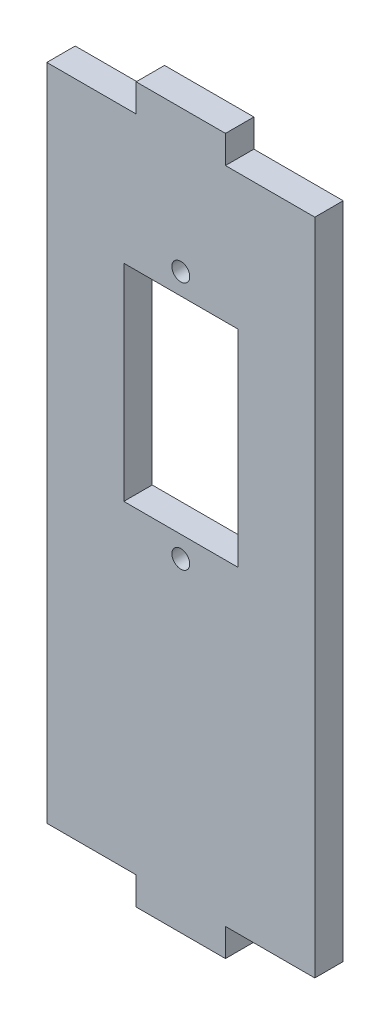
ISO-10303-21;
HEADER;
FILE_DESCRIPTION(('STEP AP214'),'2;1');
FILE_NAME('part.step','',(''),(''),'','','');
FILE_SCHEMA(('AUTOMOTIVE_DESIGN { 1 0 10303 214 1 1 1 1 }'));
ENDSEC;
DATA;
#1=APPLICATION_CONTEXT('core data for automotive mechanical design processes');
#2=APPLICATION_PROTOCOL_DEFINITION('international standard','automotive_design',2000,#1);
#3=PRODUCT_CONTEXT('',#1,'mechanical');
#4=PRODUCT('Part','Part','',(#3));
#5=PRODUCT_RELATED_PRODUCT_CATEGORY('part','',(#4));
#6=PRODUCT_DEFINITION_FORMATION('','',#4);
#7=PRODUCT_DEFINITION_CONTEXT('part definition',#1,'design');
#8=PRODUCT_DEFINITION('design','',#6,#7);
#9=PRODUCT_DEFINITION_SHAPE('','',#8);
#10=(LENGTH_UNIT() NAMED_UNIT(*) SI_UNIT(.MILLI.,.METRE.));
#11=(NAMED_UNIT(*) PLANE_ANGLE_UNIT() SI_UNIT($,.RADIAN.));
#12=(NAMED_UNIT(*) SI_UNIT($,.STERADIAN.) SOLID_ANGLE_UNIT());
#13=UNCERTAINTY_MEASURE_WITH_UNIT(LENGTH_MEASURE(1.E-05),#10,'distance_accuracy_value','');
#14=(GEOMETRIC_REPRESENTATION_CONTEXT(3) GLOBAL_UNCERTAINTY_ASSIGNED_CONTEXT((#13)) GLOBAL_UNIT_ASSIGNED_CONTEXT((#10,
#11,#12)) REPRESENTATION_CONTEXT('',''));
#15=CARTESIAN_POINT('',(0.,0.,0.));
#16=DIRECTION('',(0.,0.,1.));
#17=DIRECTION('',(1.,0.,0.));
#18=AXIS2_PLACEMENT_3D('',#15,#16,#17);
#19=CARTESIAN_POINT('',(0.,0.,3.18));
#20=DIRECTION('',(0.,0.,1.));
#21=DIRECTION('',(1.,0.,0.));
#22=AXIS2_PLACEMENT_3D('',#19,#20,#21);
#23=PLANE('',#22);
#24=CARTESIAN_POINT('',(0.,24.1003609859653,3.18000000000001));
#25=DIRECTION('',(0.,0.,-1.));
#26=DIRECTION('',(-1.,0.,0.));
#27=AXIS2_PLACEMENT_3D('',#24,#25,#26);
#28=CIRCLE('',#27,0.999999999999999);
#29=CARTESIAN_POINT('',(-1.,24.1003609859653,3.18000000000001));
#30=VERTEX_POINT('',#29);
#31=EDGE_CURVE('E552',#30,#30,#28,.T.);
#32=ORIENTED_EDGE('',*,*,#31,.T.);
#33=EDGE_LOOP('',(#32));
#34=FACE_BOUND('',#33,.T.);
#35=CARTESIAN_POINT('',(0.,-3.74598658140914,3.18000000000001));
#36=DIRECTION('',(0.,0.,-1.));
#37=DIRECTION('',(-1.,0.,0.));
#38=AXIS2_PLACEMENT_3D('',#35,#36,#37);
#39=CIRCLE('',#38,1.);
#40=CARTESIAN_POINT('',(-1.,-3.74598658140914,3.18000000000001));
#41=VERTEX_POINT('',#40);
#42=EDGE_CURVE('E557',#41,#41,#39,.T.);
#43=ORIENTED_EDGE('',*,*,#42,.T.);
#44=EDGE_LOOP('',(#43));
#45=FACE_BOUND('',#44,.T.);
#46=DIRECTION('',(1.,0.,0.));
#47=VECTOR('',#46,1.);
#48=CARTESIAN_POINT('',(-6.38,21.7253609859653,3.18));
#49=LINE('',#48,#47);
#50=CARTESIAN_POINT('',(-6.38,21.7253609859653,3.18));
#51=VERTEX_POINT('',#50);
#52=CARTESIAN_POINT('',(6.38,21.7253609859653,3.18000000000001));
#53=VERTEX_POINT('',#52);
#54=EDGE_CURVE('E182',#51,#53,#49,.T.);
#55=ORIENTED_EDGE('',*,*,#54,.T.);
#56=DIRECTION('',(0.,-1.,0.));
#57=VECTOR('',#56,1.);
#58=CARTESIAN_POINT('',(6.38,21.7253609859653,3.18));
#59=LINE('',#58,#57);
#60=CARTESIAN_POINT('',(6.38,-1.36598658140914,3.18));
#61=VERTEX_POINT('',#60);
#62=EDGE_CURVE('E168',#53,#61,#59,.T.);
#63=ORIENTED_EDGE('',*,*,#62,.T.);
#64=DIRECTION('',(-1.,0.,0.));
#65=VECTOR('',#64,1.);
#66=CARTESIAN_POINT('',(-6.38000000000001,-1.36598658140913,3.18));
#67=LINE('',#66,#65);
#68=CARTESIAN_POINT('',(-6.38000000000001,-1.36598658140913,3.18));
#69=VERTEX_POINT('',#68);
#70=EDGE_CURVE('E203',#61,#69,#67,.T.);
#71=ORIENTED_EDGE('',*,*,#70,.T.);
#72=DIRECTION('',(0.,1.,0.));
#73=VECTOR('',#72,1.);
#74=CARTESIAN_POINT('',(-6.38,21.7253609859653,3.18));
#75=LINE('',#74,#73);
#76=EDGE_CURVE('E190',#69,#51,#75,.T.);
#77=ORIENTED_EDGE('',*,*,#76,.T.);
#78=EDGE_LOOP('',(#55,#63,#71,#77));
#79=FACE_BOUND('',#78,.T.);
#80=DIRECTION('',(0.,1.,0.));
#81=VECTOR('',#80,1.);
#82=CARTESIAN_POINT('',(5.,-40.,3.18));
#83=LINE('',#82,#81);
#84=CARTESIAN_POINT('',(5.,-40.,3.18));
#85=VERTEX_POINT('',#84);
#86=CARTESIAN_POINT('',(5.,-36.88,3.18));
#87=VERTEX_POINT('',#86);
#88=EDGE_CURVE('E212',#85,#87,#83,.T.);
#89=ORIENTED_EDGE('',*,*,#88,.T.);
#90=DIRECTION('',(1.,0.,0.));
#91=VECTOR('',#90,1.);
#92=CARTESIAN_POINT('',(5.,-36.88,3.18));
#93=LINE('',#92,#91);
#94=CARTESIAN_POINT('',(15.,-36.88,3.18));
#95=VERTEX_POINT('',#94);
#96=EDGE_CURVE('E226',#87,#95,#93,.T.);
#97=ORIENTED_EDGE('',*,*,#96,.T.);
#98=DIRECTION('',(0.,1.,0.));
#99=VECTOR('',#98,1.);
#100=CARTESIAN_POINT('',(15.,-40.,3.18));
#101=LINE('',#100,#99);
#102=CARTESIAN_POINT('',(15.,36.88,3.18));
#103=VERTEX_POINT('',#102);
#104=EDGE_CURVE('E61',#95,#103,#101,.T.);
#105=ORIENTED_EDGE('',*,*,#104,.T.);
#106=DIRECTION('',(1.,0.,0.));
#107=VECTOR('',#106,1.);
#108=CARTESIAN_POINT('',(5.,36.88,3.18));
#109=LINE('',#108,#107);
#110=CARTESIAN_POINT('',(5.,36.88,3.18));
#111=VERTEX_POINT('',#110);
#112=EDGE_CURVE('E296',#111,#103,#109,.T.);
#113=ORIENTED_EDGE('',*,*,#112,.F.);
#114=DIRECTION('',(0.,-1.,0.));
#115=VECTOR('',#114,1.);
#116=CARTESIAN_POINT('',(5.,40.,3.18));
#117=LINE('',#116,#115);
#118=CARTESIAN_POINT('',(5.,40.,3.18));
#119=VERTEX_POINT('',#118);
#120=EDGE_CURVE('E271',#119,#111,#117,.T.);
#121=ORIENTED_EDGE('',*,*,#120,.F.);
#122=DIRECTION('',(-1.,0.,0.));
#123=VECTOR('',#122,1.);
#124=CARTESIAN_POINT('',(15.,40.,3.18));
#125=LINE('',#124,#123);
#126=CARTESIAN_POINT('',(-5.,40.,3.18));
#127=VERTEX_POINT('',#126);
#128=EDGE_CURVE('E13',#119,#127,#125,.T.);
#129=ORIENTED_EDGE('',*,*,#128,.T.);
#130=DIRECTION('',(0.,-1.,0.));
#131=VECTOR('',#130,1.);
#132=CARTESIAN_POINT('',(-5.,40.,3.18));
#133=LINE('',#132,#131);
#134=CARTESIAN_POINT('',(-5.,36.88,3.18));
#135=VERTEX_POINT('',#134);
#136=EDGE_CURVE('E261',#127,#135,#133,.T.);
#137=ORIENTED_EDGE('',*,*,#136,.T.);
#138=DIRECTION('',(-1.,0.,0.));
#139=VECTOR('',#138,1.);
#140=CARTESIAN_POINT('',(-5.,36.88,3.18));
#141=LINE('',#140,#139);
#142=CARTESIAN_POINT('',(-15.,36.88,3.18));
#143=VERTEX_POINT('',#142);
#144=EDGE_CURVE('E275',#135,#143,#141,.T.);
#145=ORIENTED_EDGE('',*,*,#144,.T.);
#146=DIRECTION('',(0.,-1.,0.));
#147=VECTOR('',#146,1.);
#148=CARTESIAN_POINT('',(-15.,-40.,3.18));
#149=LINE('',#148,#147);
#150=CARTESIAN_POINT('',(-15.,-36.88,3.18));
#151=VERTEX_POINT('',#150);
#152=EDGE_CURVE('E312',#143,#151,#149,.T.);
#153=ORIENTED_EDGE('',*,*,#152,.T.);
#154=DIRECTION('',(-1.,0.,0.));
#155=VECTOR('',#154,1.);
#156=CARTESIAN_POINT('',(-5.,-36.88,3.18));
#157=LINE('',#156,#155);
#158=CARTESIAN_POINT('',(-5.,-36.88,3.18));
#159=VERTEX_POINT('',#158);
#160=EDGE_CURVE('E247',#159,#151,#157,.T.);
#161=ORIENTED_EDGE('',*,*,#160,.F.);
#162=DIRECTION('',(0.,1.,0.));
#163=VECTOR('',#162,1.);
#164=CARTESIAN_POINT('',(-5.,-40.,3.18));
#165=LINE('',#164,#163);
#166=CARTESIAN_POINT('',(-5.,-40.,3.18));
#167=VERTEX_POINT('',#166);
#168=EDGE_CURVE('E222',#167,#159,#165,.T.);
#169=ORIENTED_EDGE('',*,*,#168,.F.);
#170=DIRECTION('',(1.,0.,0.));
#171=VECTOR('',#170,1.);
#172=CARTESIAN_POINT('',(15.,-40.,3.18));
#173=LINE('',#172,#171);
#174=EDGE_CURVE('E316',#167,#85,#173,.T.);
#175=ORIENTED_EDGE('',*,*,#174,.T.);
#176=EDGE_LOOP('',(#89,#97,#105,#113,#121,#129,#137,#145,#153,#161,#169,#175));
#177=FACE_BOUND('',#176,.T.);
#178=ADVANCED_FACE('F51',(#34,#45,#79,#177),#23,.T.);
#179=CARTESIAN_POINT('',(0.,0.,0.));
#180=DIRECTION('',(0.,0.,1.));
#181=DIRECTION('',(1.,0.,0.));
#182=AXIS2_PLACEMENT_3D('',#179,#180,#181);
#183=PLANE('',#182);
#184=CARTESIAN_POINT('',(0.,24.1003609859653,0.));
#185=DIRECTION('',(0.,0.,-1.));
#186=DIRECTION('',(-1.,0.,0.));
#187=AXIS2_PLACEMENT_3D('',#184,#185,#186);
#188=CIRCLE('',#187,0.999999999999999);
#189=CARTESIAN_POINT('',(-1.,24.1003609859653,0.));
#190=VERTEX_POINT('',#189);
#191=EDGE_CURVE('E555',#190,#190,#188,.T.);
#192=ORIENTED_EDGE('',*,*,#191,.F.);
#193=EDGE_LOOP('',(#192));
#194=FACE_BOUND('',#193,.T.);
#195=CARTESIAN_POINT('',(0.,-3.74598658140914,0.));
#196=DIRECTION('',(0.,0.,-1.));
#197=DIRECTION('',(-1.,0.,0.));
#198=AXIS2_PLACEMENT_3D('',#195,#196,#197);
#199=CIRCLE('',#198,1.);
#200=CARTESIAN_POINT('',(-1.,-3.74598658140914,0.));
#201=VERTEX_POINT('',#200);
#202=EDGE_CURVE('E563',#201,#201,#199,.T.);
#203=ORIENTED_EDGE('',*,*,#202,.F.);
#204=EDGE_LOOP('',(#203));
#205=FACE_BOUND('',#204,.T.);
#206=DIRECTION('',(0.,-1.,0.));
#207=VECTOR('',#206,1.);
#208=CARTESIAN_POINT('',(6.38,21.7253609859653,0.));
#209=LINE('',#208,#207);
#210=CARTESIAN_POINT('',(6.38,21.7253609859653,0.));
#211=VERTEX_POINT('',#210);
#212=CARTESIAN_POINT('',(6.38,-1.36598658140914,0.));
#213=VERTEX_POINT('',#212);
#214=EDGE_CURVE('E194',#211,#213,#209,.T.);
#215=ORIENTED_EDGE('',*,*,#214,.F.);
#216=DIRECTION('',(1.,0.,0.));
#217=VECTOR('',#216,1.);
#218=CARTESIAN_POINT('',(-6.38,21.7253609859653,0.));
#219=LINE('',#218,#217);
#220=CARTESIAN_POINT('',(-6.38,21.7253609859653,0.));
#221=VERTEX_POINT('',#220);
#222=EDGE_CURVE('E185',#221,#211,#219,.T.);
#223=ORIENTED_EDGE('',*,*,#222,.F.);
#224=DIRECTION('',(0.,1.,0.));
#225=VECTOR('',#224,1.);
#226=CARTESIAN_POINT('',(-6.38,21.7253609859653,0.));
#227=LINE('',#226,#225);
#228=CARTESIAN_POINT('',(-6.38000000000001,-1.36598658140913,0.));
#229=VERTEX_POINT('',#228);
#230=EDGE_CURVE('E198',#229,#221,#227,.T.);
#231=ORIENTED_EDGE('',*,*,#230,.F.);
#232=DIRECTION('',(-1.,0.,0.));
#233=VECTOR('',#232,1.);
#234=CARTESIAN_POINT('',(-6.38000000000001,-1.36598658140913,0.));
#235=LINE('',#234,#233);
#236=EDGE_CURVE('E77',#213,#229,#235,.T.);
#237=ORIENTED_EDGE('',*,*,#236,.F.);
#238=EDGE_LOOP('',(#215,#223,#231,#237));
#239=FACE_BOUND('',#238,.T.);
#240=DIRECTION('',(-1.,0.,0.));
#241=VECTOR('',#240,1.);
#242=CARTESIAN_POINT('',(5.,-36.88,0.));
#243=LINE('',#242,#241);
#244=CARTESIAN_POINT('',(15.,-36.88,0.));
#245=VERTEX_POINT('',#244);
#246=CARTESIAN_POINT('',(5.,-36.88,0.));
#247=VERTEX_POINT('',#246);
#248=EDGE_CURVE('E213',#245,#247,#243,.T.);
#249=ORIENTED_EDGE('',*,*,#248,.T.);
#250=DIRECTION('',(0.,-1.,0.));
#251=VECTOR('',#250,1.);
#252=CARTESIAN_POINT('',(5.,-40.,0.));
#253=LINE('',#252,#251);
#254=CARTESIAN_POINT('',(5.,-40.,0.));
#255=VERTEX_POINT('',#254);
#256=EDGE_CURVE('E217',#247,#255,#253,.T.);
#257=ORIENTED_EDGE('',*,*,#256,.T.);
#258=DIRECTION('',(1.,0.,0.));
#259=VECTOR('',#258,1.);
#260=CARTESIAN_POINT('',(15.,-40.,0.));
#261=LINE('',#260,#259);
#262=CARTESIAN_POINT('',(-5.,-40.,0.));
#263=VERTEX_POINT('',#262);
#264=EDGE_CURVE('E325',#263,#255,#261,.T.);
#265=ORIENTED_EDGE('',*,*,#264,.F.);
#266=DIRECTION('',(0.,-1.,0.));
#267=VECTOR('',#266,1.);
#268=CARTESIAN_POINT('',(-5.,-40.,0.));
#269=LINE('',#268,#267);
#270=CARTESIAN_POINT('',(-5.,-36.88,0.));
#271=VERTEX_POINT('',#270);
#272=EDGE_CURVE('E239',#271,#263,#269,.T.);
#273=ORIENTED_EDGE('',*,*,#272,.F.);
#274=DIRECTION('',(1.,0.,0.));
#275=VECTOR('',#274,1.);
#276=CARTESIAN_POINT('',(-5.,-36.88,0.));
#277=LINE('',#276,#275);
#278=CARTESIAN_POINT('',(-15.,-36.88,0.));
#279=VERTEX_POINT('',#278);
#280=EDGE_CURVE('E242',#279,#271,#277,.T.);
#281=ORIENTED_EDGE('',*,*,#280,.F.);
#282=DIRECTION('',(0.,-1.,0.));
#283=VECTOR('',#282,1.);
#284=CARTESIAN_POINT('',(-15.,-40.,0.));
#285=LINE('',#284,#283);
#286=CARTESIAN_POINT('',(-15.,36.88,0.));
#287=VERTEX_POINT('',#286);
#288=EDGE_CURVE('E311',#287,#279,#285,.T.);
#289=ORIENTED_EDGE('',*,*,#288,.F.);
#290=DIRECTION('',(1.,0.,0.));
#291=VECTOR('',#290,1.);
#292=CARTESIAN_POINT('',(-5.,36.88,0.));
#293=LINE('',#292,#291);
#294=CARTESIAN_POINT('',(-5.,36.88,0.));
#295=VERTEX_POINT('',#294);
#296=EDGE_CURVE('E262',#287,#295,#293,.T.);
#297=ORIENTED_EDGE('',*,*,#296,.T.);
#298=DIRECTION('',(0.,1.,0.));
#299=VECTOR('',#298,1.);
#300=CARTESIAN_POINT('',(-5.,40.,0.));
#301=LINE('',#300,#299);
#302=CARTESIAN_POINT('',(-5.,40.,0.));
#303=VERTEX_POINT('',#302);
#304=EDGE_CURVE('E266',#295,#303,#301,.T.);
#305=ORIENTED_EDGE('',*,*,#304,.T.);
#306=DIRECTION('',(-1.,0.,0.));
#307=VECTOR('',#306,1.);
#308=CARTESIAN_POINT('',(15.,40.,0.));
#309=LINE('',#308,#307);
#310=CARTESIAN_POINT('',(5.,40.,0.));
#311=VERTEX_POINT('',#310);
#312=EDGE_CURVE('E55',#311,#303,#309,.T.);
#313=ORIENTED_EDGE('',*,*,#312,.F.);
#314=DIRECTION('',(0.,1.,0.));
#315=VECTOR('',#314,1.);
#316=CARTESIAN_POINT('',(5.,40.,0.));
#317=LINE('',#316,#315);
#318=CARTESIAN_POINT('',(5.,36.88,0.));
#319=VERTEX_POINT('',#318);
#320=EDGE_CURVE('E288',#319,#311,#317,.T.);
#321=ORIENTED_EDGE('',*,*,#320,.F.);
#322=DIRECTION('',(-1.,0.,0.));
#323=VECTOR('',#322,1.);
#324=CARTESIAN_POINT('',(5.,36.88,0.));
#325=LINE('',#324,#323);
#326=CARTESIAN_POINT('',(15.,36.88,0.));
#327=VERTEX_POINT('',#326);
#328=EDGE_CURVE('E291',#327,#319,#325,.T.);
#329=ORIENTED_EDGE('',*,*,#328,.F.);
#330=DIRECTION('',(0.,1.,0.));
#331=VECTOR('',#330,1.);
#332=CARTESIAN_POINT('',(15.,-40.,0.));
#333=LINE('',#332,#331);
#334=EDGE_CURVE('E328',#245,#327,#333,.T.);
#335=ORIENTED_EDGE('',*,*,#334,.F.);
#336=EDGE_LOOP('',(#249,#257,#265,#273,#281,#289,#297,#305,#313,#321,#329,#335));
#337=FACE_BOUND('',#336,.T.);
#338=ADVANCED_FACE('F343',(#194,#205,#239,#337),#183,.F.);
#339=CARTESIAN_POINT('',(15.,-40.,3.18));
#340=DIRECTION('',(0.,1.,0.));
#341=DIRECTION('',(0.,0.,1.));
#342=AXIS2_PLACEMENT_3D('',#339,#340,#341);
#343=PLANE('',#342);
#344=DIRECTION('',(0.,0.,1.));
#345=VECTOR('',#344,1.);
#346=CARTESIAN_POINT('',(5.,-40.,-10.4754188460414));
#347=LINE('',#346,#345);
#348=EDGE_CURVE('E230',#255,#85,#347,.T.);
#349=ORIENTED_EDGE('',*,*,#348,.T.);
#350=ORIENTED_EDGE('',*,*,#174,.F.);
#351=DIRECTION('',(0.,0.,1.));
#352=VECTOR('',#351,1.);
#353=CARTESIAN_POINT('',(-5.,-40.,-10.4754188460414));
#354=LINE('',#353,#352);
#355=EDGE_CURVE('E243',#263,#167,#354,.T.);
#356=ORIENTED_EDGE('',*,*,#355,.F.);
#357=ORIENTED_EDGE('',*,*,#264,.T.);
#358=EDGE_LOOP('',(#349,#350,#356,#357));
#359=FACE_BOUND('',#358,.T.);
#360=ADVANCED_FACE('F373',(#359),#343,.F.);
#361=CARTESIAN_POINT('',(15.,-40.,3.18));
#362=DIRECTION('',(-1.,0.,0.));
#363=DIRECTION('',(0.,0.,1.));
#364=AXIS2_PLACEMENT_3D('',#361,#362,#363);
#365=PLANE('',#364);
#366=DIRECTION('',(0.,0.,1.));
#367=VECTOR('',#366,1.);
#368=CARTESIAN_POINT('',(15.,-36.88,-10.4754188460414));
#369=LINE('',#368,#367);
#370=EDGE_CURVE('E233',#245,#95,#369,.T.);
#371=ORIENTED_EDGE('',*,*,#370,.F.);
#372=ORIENTED_EDGE('',*,*,#334,.T.);
#373=DIRECTION('',(0.,0.,1.));
#374=VECTOR('',#373,1.);
#375=CARTESIAN_POINT('',(15.,36.88,-10.4754188460414));
#376=LINE('',#375,#374);
#377=EDGE_CURVE('E303',#327,#103,#376,.T.);
#378=ORIENTED_EDGE('',*,*,#377,.T.);
#379=ORIENTED_EDGE('',*,*,#104,.F.);
#380=EDGE_LOOP('',(#371,#372,#378,#379));
#381=FACE_BOUND('',#380,.T.);
#382=ADVANCED_FACE('F367',(#381),#365,.F.);
#383=CARTESIAN_POINT('',(-15.,-40.,3.18));
#384=DIRECTION('',(1.,0.,0.));
#385=DIRECTION('',(0.,0.,-1.));
#386=AXIS2_PLACEMENT_3D('',#383,#384,#385);
#387=PLANE('',#386);
#388=ORIENTED_EDGE('',*,*,#288,.T.);
#389=DIRECTION('',(0.,0.,1.));
#390=VECTOR('',#389,1.);
#391=CARTESIAN_POINT('',(-15.,-36.88,-10.4754188460414));
#392=LINE('',#391,#390);
#393=EDGE_CURVE('E253',#279,#151,#392,.T.);
#394=ORIENTED_EDGE('',*,*,#393,.T.);
#395=ORIENTED_EDGE('',*,*,#152,.F.);
#396=DIRECTION('',(0.,0.,1.));
#397=VECTOR('',#396,1.);
#398=CARTESIAN_POINT('',(-15.,36.88,-10.4754188460414));
#399=LINE('',#398,#397);
#400=EDGE_CURVE('E282',#287,#143,#399,.T.);
#401=ORIENTED_EDGE('',*,*,#400,.F.);
#402=EDGE_LOOP('',(#388,#394,#395,#401));
#403=FACE_BOUND('',#402,.T.);
#404=ADVANCED_FACE('F53',(#403),#387,.F.);
#405=CARTESIAN_POINT('',(15.,40.,3.18));
#406=DIRECTION('',(0.,-1.,0.));
#407=DIRECTION('',(1.,0.,0.));
#408=AXIS2_PLACEMENT_3D('',#405,#406,#407);
#409=PLANE('',#408);
#410=DIRECTION('',(0.,0.,1.));
#411=VECTOR('',#410,1.);
#412=CARTESIAN_POINT('',(-5.,40.,-10.4754188460414));
#413=LINE('',#412,#411);
#414=EDGE_CURVE('E279',#303,#127,#413,.T.);
#415=ORIENTED_EDGE('',*,*,#414,.T.);
#416=ORIENTED_EDGE('',*,*,#128,.F.);
#417=DIRECTION('',(0.,0.,1.));
#418=VECTOR('',#417,1.);
#419=CARTESIAN_POINT('',(5.,40.,-10.4754188460414));
#420=LINE('',#419,#418);
#421=EDGE_CURVE('E292',#311,#119,#420,.T.);
#422=ORIENTED_EDGE('',*,*,#421,.F.);
#423=ORIENTED_EDGE('',*,*,#312,.T.);
#424=EDGE_LOOP('',(#415,#416,#422,#423));
#425=FACE_BOUND('',#424,.T.);
#426=ADVANCED_FACE('F339',(#425),#409,.F.);
#427=CARTESIAN_POINT('',(5.,40.,-10.4754188460414));
#428=DIRECTION('',(-1.,0.,0.));
#429=DIRECTION('',(0.,0.,1.));
#430=AXIS2_PLACEMENT_3D('',#427,#428,#429);
#431=PLANE('',#430);
#432=ORIENTED_EDGE('',*,*,#320,.T.);
#433=ORIENTED_EDGE('',*,*,#421,.T.);
#434=ORIENTED_EDGE('',*,*,#120,.T.);
#435=DIRECTION('',(0.,0.,1.));
#436=VECTOR('',#435,1.);
#437=CARTESIAN_POINT('',(5.,36.88,-10.4754188460414));
#438=LINE('',#437,#436);
#439=EDGE_CURVE('E300',#319,#111,#438,.T.);
#440=ORIENTED_EDGE('',*,*,#439,.F.);
#441=EDGE_LOOP('',(#432,#433,#434,#440));
#442=FACE_BOUND('',#441,.T.);
#443=ADVANCED_FACE('F358',(#442),#431,.F.);
#444=CARTESIAN_POINT('',(5.,36.88,-10.4754188460414));
#445=DIRECTION('',(0.,-1.,0.));
#446=DIRECTION('',(0.,0.,-1.));
#447=AXIS2_PLACEMENT_3D('',#444,#445,#446);
#448=PLANE('',#447);
#449=ORIENTED_EDGE('',*,*,#328,.T.);
#450=ORIENTED_EDGE('',*,*,#439,.T.);
#451=ORIENTED_EDGE('',*,*,#112,.T.);
#452=ORIENTED_EDGE('',*,*,#377,.F.);
#453=EDGE_LOOP('',(#449,#450,#451,#452));
#454=FACE_BOUND('',#453,.T.);
#455=ADVANCED_FACE('F360',(#454),#448,.F.);
#456=CARTESIAN_POINT('',(-5.,36.88,-10.4754188460414));
#457=DIRECTION('',(0.,1.,0.));
#458=DIRECTION('',(0.,0.,1.));
#459=AXIS2_PLACEMENT_3D('',#456,#457,#458);
#460=PLANE('',#459);
#461=ORIENTED_EDGE('',*,*,#400,.T.);
#462=ORIENTED_EDGE('',*,*,#144,.F.);
#463=DIRECTION('',(0.,0.,1.));
#464=VECTOR('',#463,1.);
#465=CARTESIAN_POINT('',(-5.,36.88,-10.4754188460414));
#466=LINE('',#465,#464);
#467=EDGE_CURVE('E267',#295,#135,#466,.T.);
#468=ORIENTED_EDGE('',*,*,#467,.F.);
#469=ORIENTED_EDGE('',*,*,#296,.F.);
#470=EDGE_LOOP('',(#461,#462,#468,#469));
#471=FACE_BOUND('',#470,.T.);
#472=ADVANCED_FACE('F351',(#471),#460,.T.);
#473=CARTESIAN_POINT('',(-5.,40.,-10.4754188460414));
#474=DIRECTION('',(-1.,0.,0.));
#475=DIRECTION('',(0.,0.,1.));
#476=AXIS2_PLACEMENT_3D('',#473,#474,#475);
#477=PLANE('',#476);
#478=ORIENTED_EDGE('',*,*,#467,.T.);
#479=ORIENTED_EDGE('',*,*,#136,.F.);
#480=ORIENTED_EDGE('',*,*,#414,.F.);
#481=ORIENTED_EDGE('',*,*,#304,.F.);
#482=EDGE_LOOP('',(#478,#479,#480,#481));
#483=FACE_BOUND('',#482,.T.);
#484=ADVANCED_FACE('F348',(#483),#477,.T.);
#485=CARTESIAN_POINT('',(-5.,-40.,-10.4754188460414));
#486=DIRECTION('',(1.,0.,0.));
#487=DIRECTION('',(0.,0.,-1.));
#488=AXIS2_PLACEMENT_3D('',#485,#486,#487);
#489=PLANE('',#488);
#490=ORIENTED_EDGE('',*,*,#272,.T.);
#491=ORIENTED_EDGE('',*,*,#355,.T.);
#492=ORIENTED_EDGE('',*,*,#168,.T.);
#493=DIRECTION('',(0.,0.,1.));
#494=VECTOR('',#493,1.);
#495=CARTESIAN_POINT('',(-5.,-36.88,-10.4754188460414));
#496=LINE('',#495,#494);
#497=EDGE_CURVE('E250',#271,#159,#496,.T.);
#498=ORIENTED_EDGE('',*,*,#497,.F.);
#499=EDGE_LOOP('',(#490,#491,#492,#498));
#500=FACE_BOUND('',#499,.T.);
#501=ADVANCED_FACE('F379',(#500),#489,.F.);
#502=CARTESIAN_POINT('',(-5.,-36.88,-10.4754188460414));
#503=DIRECTION('',(0.,1.,0.));
#504=DIRECTION('',(0.,0.,1.));
#505=AXIS2_PLACEMENT_3D('',#502,#503,#504);
#506=PLANE('',#505);
#507=ORIENTED_EDGE('',*,*,#280,.T.);
#508=ORIENTED_EDGE('',*,*,#497,.T.);
#509=ORIENTED_EDGE('',*,*,#160,.T.);
#510=ORIENTED_EDGE('',*,*,#393,.F.);
#511=EDGE_LOOP('',(#507,#508,#509,#510));
#512=FACE_BOUND('',#511,.T.);
#513=ADVANCED_FACE('F382',(#512),#506,.F.);
#514=CARTESIAN_POINT('',(5.,-36.88,-10.4754188460414));
#515=DIRECTION('',(0.,-1.,0.));
#516=DIRECTION('',(0.,0.,-1.));
#517=AXIS2_PLACEMENT_3D('',#514,#515,#516);
#518=PLANE('',#517);
#519=ORIENTED_EDGE('',*,*,#370,.T.);
#520=ORIENTED_EDGE('',*,*,#96,.F.);
#521=DIRECTION('',(0.,0.,1.));
#522=VECTOR('',#521,1.);
#523=CARTESIAN_POINT('',(5.,-36.88,-10.4754188460414));
#524=LINE('',#523,#522);
#525=EDGE_CURVE('E218',#247,#87,#524,.T.);
#526=ORIENTED_EDGE('',*,*,#525,.F.);
#527=ORIENTED_EDGE('',*,*,#248,.F.);
#528=EDGE_LOOP('',(#519,#520,#526,#527));
#529=FACE_BOUND('',#528,.T.);
#530=ADVANCED_FACE('F364',(#529),#518,.T.);
#531=CARTESIAN_POINT('',(5.,-40.,-10.4754188460414));
#532=DIRECTION('',(1.,0.,0.));
#533=DIRECTION('',(0.,0.,-1.));
#534=AXIS2_PLACEMENT_3D('',#531,#532,#533);
#535=PLANE('',#534);
#536=ORIENTED_EDGE('',*,*,#525,.T.);
#537=ORIENTED_EDGE('',*,*,#88,.F.);
#538=ORIENTED_EDGE('',*,*,#348,.F.);
#539=ORIENTED_EDGE('',*,*,#256,.F.);
#540=EDGE_LOOP('',(#536,#537,#538,#539));
#541=FACE_BOUND('',#540,.T.);
#542=ADVANCED_FACE('F371',(#541),#535,.T.);
#543=CARTESIAN_POINT('',(-6.38,21.7253609859653,29.5623413001441));
#544=DIRECTION('',(0.,1.,0.));
#545=DIRECTION('',(0.,0.,1.));
#546=AXIS2_PLACEMENT_3D('',#543,#544,#545);
#547=PLANE('',#546);
#548=DIRECTION('',(0.,0.,-1.));
#549=VECTOR('',#548,1.);
#550=CARTESIAN_POINT('',(-6.38,21.7253609859653,29.5623413001441));
#551=LINE('',#550,#549);
#552=EDGE_CURVE('E69',#51,#221,#551,.T.);
#553=ORIENTED_EDGE('',*,*,#552,.T.);
#554=ORIENTED_EDGE('',*,*,#222,.T.);
#555=DIRECTION('',(0.,0.,-1.));
#556=VECTOR('',#555,1.);
#557=CARTESIAN_POINT('',(6.38,21.7253609859653,29.5623413001441));
#558=LINE('',#557,#556);
#559=EDGE_CURVE('E172',#53,#211,#558,.T.);
#560=ORIENTED_EDGE('',*,*,#559,.F.);
#561=ORIENTED_EDGE('',*,*,#54,.F.);
#562=EDGE_LOOP('',(#553,#554,#560,#561));
#563=FACE_BOUND('',#562,.T.);
#564=ADVANCED_FACE('F181',(#563),#547,.F.);
#565=CARTESIAN_POINT('',(6.38,21.7253609859653,29.5623413001441));
#566=DIRECTION('',(1.,0.,0.));
#567=DIRECTION('',(0.,1.,0.));
#568=AXIS2_PLACEMENT_3D('',#565,#566,#567);
#569=PLANE('',#568);
#570=ORIENTED_EDGE('',*,*,#559,.T.);
#571=ORIENTED_EDGE('',*,*,#214,.T.);
#572=DIRECTION('',(0.,0.,-1.));
#573=VECTOR('',#572,1.);
#574=CARTESIAN_POINT('',(6.38,-1.36598658140914,29.5623413001441));
#575=LINE('',#574,#573);
#576=EDGE_CURVE('E174',#61,#213,#575,.T.);
#577=ORIENTED_EDGE('',*,*,#576,.F.);
#578=ORIENTED_EDGE('',*,*,#62,.F.);
#579=EDGE_LOOP('',(#570,#571,#577,#578));
#580=FACE_BOUND('',#579,.T.);
#581=ADVANCED_FACE('F170',(#580),#569,.F.);
#582=CARTESIAN_POINT('',(-6.38000000000001,-1.36598658140913,29.5623413001441));
#583=DIRECTION('',(0.,-1.,0.));
#584=DIRECTION('',(1.,0.,0.));
#585=AXIS2_PLACEMENT_3D('',#582,#583,#584);
#586=PLANE('',#585);
#587=ORIENTED_EDGE('',*,*,#576,.T.);
#588=ORIENTED_EDGE('',*,*,#236,.T.);
#589=DIRECTION('',(0.,0.,-1.));
#590=VECTOR('',#589,1.);
#591=CARTESIAN_POINT('',(-6.38000000000001,-1.36598658140913,29.5623413001441));
#592=LINE('',#591,#590);
#593=EDGE_CURVE('E202',#69,#229,#592,.T.);
#594=ORIENTED_EDGE('',*,*,#593,.F.);
#595=ORIENTED_EDGE('',*,*,#70,.F.);
#596=EDGE_LOOP('',(#587,#588,#594,#595));
#597=FACE_BOUND('',#596,.T.);
#598=ADVANCED_FACE('F471',(#597),#586,.F.);
#599=CARTESIAN_POINT('',(-6.38,21.7253609859653,29.5623413001441));
#600=DIRECTION('',(-1.,0.,0.));
#601=DIRECTION('',(0.,-1.,0.));
#602=AXIS2_PLACEMENT_3D('',#599,#600,#601);
#603=PLANE('',#602);
#604=ORIENTED_EDGE('',*,*,#593,.T.);
#605=ORIENTED_EDGE('',*,*,#230,.T.);
#606=ORIENTED_EDGE('',*,*,#552,.F.);
#607=ORIENTED_EDGE('',*,*,#76,.F.);
#608=EDGE_LOOP('',(#604,#605,#606,#607));
#609=FACE_BOUND('',#608,.T.);
#610=ADVANCED_FACE('F480',(#609),#603,.F.);
#611=CARTESIAN_POINT('',(0.,-3.74598658140914,3.18000000000001));
#612=DIRECTION('',(0.,0.,-1.));
#613=DIRECTION('',(-1.,0.,0.));
#614=AXIS2_PLACEMENT_3D('',#611,#612,#613);
#615=CYLINDRICAL_SURFACE('',#614,1.);
#616=ORIENTED_EDGE('',*,*,#42,.F.);
#617=EDGE_LOOP('',(#616));
#618=FACE_BOUND('',#617,.T.);
#619=ORIENTED_EDGE('',*,*,#202,.T.);
#620=EDGE_LOOP('',(#619));
#621=FACE_BOUND('',#620,.T.);
#622=ADVANCED_FACE('F488',(#618,#621),#615,.F.);
#623=CARTESIAN_POINT('',(0.,24.1003609859653,3.18000000000001));
#624=DIRECTION('',(0.,0.,-1.));
#625=DIRECTION('',(-1.,0.,0.));
#626=AXIS2_PLACEMENT_3D('',#623,#624,#625);
#627=CYLINDRICAL_SURFACE('',#626,0.999999999999999);
#628=ORIENTED_EDGE('',*,*,#31,.F.);
#629=EDGE_LOOP('',(#628));
#630=FACE_BOUND('',#629,.T.);
#631=ORIENTED_EDGE('',*,*,#191,.T.);
#632=EDGE_LOOP('',(#631));
#633=FACE_BOUND('',#632,.T.);
#634=ADVANCED_FACE('F505',(#630,#633),#627,.F.);
#635=CLOSED_SHELL('',(#178,#338,#360,#382,#404,#426,#443,#455,#472,#484,#501,#513,#530,#542,
#564,#581,#598,#610,#622,#634));
#636=MANIFOLD_SOLID_BREP('B2',#635);
#637=ADVANCED_BREP_SHAPE_REPRESENTATION('',(#18,#636),#14);
#638=SHAPE_DEFINITION_REPRESENTATION(#9,#637);
ENDSEC;
END-ISO-10303-21;
